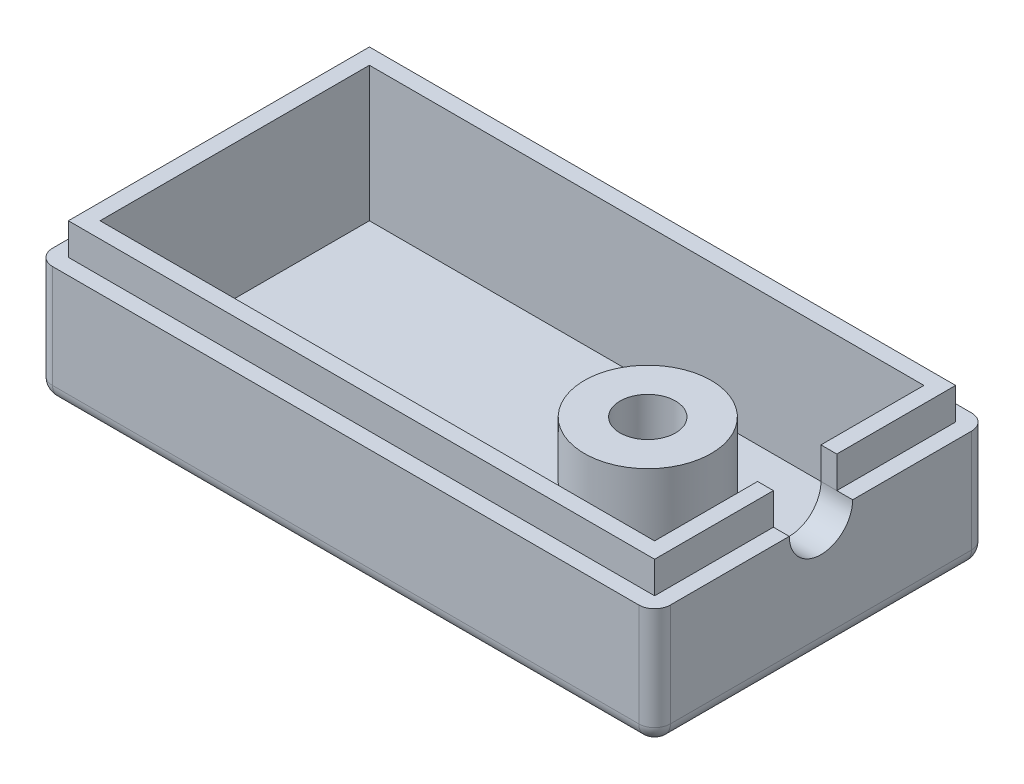
ISO-10303-21;
HEADER;
FILE_DESCRIPTION(('STEP AP214'),'2;1');
FILE_NAME('part.step','',(''),(''),'','','');
FILE_SCHEMA(('AUTOMOTIVE_DESIGN { 1 0 10303 214 1 1 1 1 }'));
ENDSEC;
DATA;
#1=APPLICATION_CONTEXT('core data for automotive mechanical design processes');
#2=APPLICATION_PROTOCOL_DEFINITION('international standard','automotive_design',2000,#1);
#3=PRODUCT_CONTEXT('',#1,'mechanical');
#4=PRODUCT('Part','Part','',(#3));
#5=PRODUCT_RELATED_PRODUCT_CATEGORY('part','',(#4));
#6=PRODUCT_DEFINITION_FORMATION('','',#4);
#7=PRODUCT_DEFINITION_CONTEXT('part definition',#1,'design');
#8=PRODUCT_DEFINITION('design','',#6,#7);
#9=PRODUCT_DEFINITION_SHAPE('','',#8);
#10=(LENGTH_UNIT() NAMED_UNIT(*) SI_UNIT(.MILLI.,.METRE.));
#11=(NAMED_UNIT(*) PLANE_ANGLE_UNIT() SI_UNIT($,.RADIAN.));
#12=(NAMED_UNIT(*) SI_UNIT($,.STERADIAN.) SOLID_ANGLE_UNIT());
#13=UNCERTAINTY_MEASURE_WITH_UNIT(LENGTH_MEASURE(1.E-05),#10,'distance_accuracy_value','');
#14=(GEOMETRIC_REPRESENTATION_CONTEXT(3) GLOBAL_UNCERTAINTY_ASSIGNED_CONTEXT((#13)) GLOBAL_UNIT_ASSIGNED_CONTEXT((#10,
#11,#12)) REPRESENTATION_CONTEXT('',''));
#15=CARTESIAN_POINT('',(0.,0.,0.));
#16=DIRECTION('',(0.,0.,1.));
#17=DIRECTION('',(1.,0.,0.));
#18=AXIS2_PLACEMENT_3D('',#15,#16,#17);
#19=CARTESIAN_POINT('',(38.,9.5,-1.));
#20=DIRECTION('',(-1.,0.,0.));
#21=DIRECTION('',(0.,0.,1.));
#22=AXIS2_PLACEMENT_3D('',#19,#20,#21);
#23=PLANE('',#22);
#24=DIRECTION('',(0.,0.,-1.));
#25=VECTOR('',#24,1.);
#26=CARTESIAN_POINT('',(38.,7.5,-1.));
#27=LINE('',#26,#25);
#28=CARTESIAN_POINT('',(38.,7.5,-1.));
#29=VERTEX_POINT('',#28);
#30=CARTESIAN_POINT('',(38.,7.5,-8.5));
#31=VERTEX_POINT('',#30);
#32=EDGE_CURVE('E367',#29,#31,#27,.T.);
#33=ORIENTED_EDGE('',*,*,#32,.T.);
#34=DIRECTION('',(0.,1.,0.));
#35=VECTOR('',#34,1.);
#36=CARTESIAN_POINT('',(38.,9.5,-8.5));
#37=LINE('',#36,#35);
#38=CARTESIAN_POINT('',(38.,9.5,-8.5));
#39=VERTEX_POINT('',#38);
#40=EDGE_CURVE('E490',#31,#39,#37,.T.);
#41=ORIENTED_EDGE('',*,*,#40,.T.);
#42=DIRECTION('',(0.,0.,-1.));
#43=VECTOR('',#42,1.);
#44=CARTESIAN_POINT('',(38.,9.5,-1.));
#45=LINE('',#44,#43);
#46=CARTESIAN_POINT('',(38.,9.5,-1.));
#47=VERTEX_POINT('',#46);
#48=EDGE_CURVE('E391',#47,#39,#45,.T.);
#49=ORIENTED_EDGE('',*,*,#48,.F.);
#50=DIRECTION('',(0.,-1.,0.));
#51=VECTOR('',#50,1.);
#52=CARTESIAN_POINT('',(38.,9.5,-1.));
#53=LINE('',#52,#51);
#54=EDGE_CURVE('E386',#47,#29,#53,.T.);
#55=ORIENTED_EDGE('',*,*,#54,.T.);
#56=EDGE_LOOP('',(#33,#41,#49,#55));
#57=FACE_BOUND('',#56,.T.);
#58=ADVANCED_FACE('F43',(#57),#23,.F.);
#59=CARTESIAN_POINT('',(28.01,-8.48528137423857,-10.56));
#60=DIRECTION('',(0.,1.,0.));
#61=DIRECTION('',(0.,0.,1.));
#62=AXIS2_PLACEMENT_3D('',#59,#60,#61);
#63=CYLINDRICAL_SURFACE('',#62,3.);
#64=CARTESIAN_POINT('',(28.01,0.,-10.56));
#65=DIRECTION('',(0.,-1.,0.));
#66=DIRECTION('',(0.,0.,-1.));
#67=AXIS2_PLACEMENT_3D('',#64,#65,#66);
#68=CIRCLE('',#67,3.);
#69=CARTESIAN_POINT('',(28.01,0.,-13.56));
#70=VERTEX_POINT('',#69);
#71=EDGE_CURVE('E478',#70,#70,#68,.F.);
#72=ORIENTED_EDGE('',*,*,#71,.F.);
#73=EDGE_LOOP('',(#72));
#74=FACE_BOUND('',#73,.T.);
#75=CARTESIAN_POINT('',(28.01,3.5,-10.56));
#76=DIRECTION('',(0.,1.,0.));
#77=DIRECTION('',(0.,0.,1.));
#78=AXIS2_PLACEMENT_3D('',#75,#76,#77);
#79=CIRCLE('',#78,3.);
#80=CARTESIAN_POINT('',(28.01,3.5,-7.56));
#81=VERTEX_POINT('',#80);
#82=EDGE_CURVE('E12',#81,#81,#79,.F.);
#83=ORIENTED_EDGE('',*,*,#82,.F.);
#84=EDGE_LOOP('',(#83));
#85=FACE_BOUND('',#84,.T.);
#86=ADVANCED_FACE('F602',(#74,#85),#63,.F.);
#87=CARTESIAN_POINT('',(0.,7.5,0.));
#88=DIRECTION('',(1.,0.,0.));
#89=DIRECTION('',(0.,0.,-1.));
#90=AXIS2_PLACEMENT_3D('',#87,#88,#89);
#91=PLANE('',#90);
#92=DIRECTION('',(0.,-1.,0.));
#93=VECTOR('',#92,1.);
#94=CARTESIAN_POINT('',(0.,7.5,-20.));
#95=LINE('',#94,#93);
#96=CARTESIAN_POINT('',(0.,7.5,-20.));
#97=VERTEX_POINT('',#96);
#98=CARTESIAN_POINT('',(0.,1.,-20.));
#99=VERTEX_POINT('',#98);
#100=EDGE_CURVE('E277',#97,#99,#95,.T.);
#101=ORIENTED_EDGE('',*,*,#100,.T.);
#102=DIRECTION('',(0.,0.,1.));
#103=VECTOR('',#102,1.);
#104=CARTESIAN_POINT('',(0.,1.,-1.));
#105=LINE('',#104,#103);
#106=CARTESIAN_POINT('',(0.,1.,-1.));
#107=VERTEX_POINT('',#106);
#108=EDGE_CURVE('E304',#99,#107,#105,.T.);
#109=ORIENTED_EDGE('',*,*,#108,.T.);
#110=DIRECTION('',(0.,-1.,0.));
#111=VECTOR('',#110,1.);
#112=CARTESIAN_POINT('',(0.,7.5,-1.));
#113=LINE('',#112,#111);
#114=CARTESIAN_POINT('',(0.,7.5,-1.));
#115=VERTEX_POINT('',#114);
#116=EDGE_CURVE('E274',#107,#115,#113,.F.);
#117=ORIENTED_EDGE('',*,*,#116,.T.);
#118=DIRECTION('',(0.,0.,1.));
#119=VECTOR('',#118,1.);
#120=CARTESIAN_POINT('',(0.,7.5,0.));
#121=LINE('',#120,#119);
#122=EDGE_CURVE('E235',#97,#115,#121,.T.);
#123=ORIENTED_EDGE('',*,*,#122,.F.);
#124=EDGE_LOOP('',(#101,#109,#117,#123));
#125=FACE_BOUND('',#124,.T.);
#126=ADVANCED_FACE('F578',(#125),#91,.F.);
#127=CARTESIAN_POINT('',(0.,7.5,0.));
#128=DIRECTION('',(0.,0.,-1.));
#129=DIRECTION('',(-1.,0.,0.));
#130=AXIS2_PLACEMENT_3D('',#127,#128,#129);
#131=PLANE('',#130);
#132=DIRECTION('',(0.,-1.,0.));
#133=VECTOR('',#132,1.);
#134=CARTESIAN_POINT('',(1.,7.5,0.));
#135=LINE('',#134,#133);
#136=CARTESIAN_POINT('',(1.,7.5,0.));
#137=VERTEX_POINT('',#136);
#138=CARTESIAN_POINT('',(1.,1.,0.));
#139=VERTEX_POINT('',#138);
#140=EDGE_CURVE('E248',#137,#139,#135,.T.);
#141=ORIENTED_EDGE('',*,*,#140,.T.);
#142=DIRECTION('',(1.,0.,0.));
#143=VECTOR('',#142,1.);
#144=CARTESIAN_POINT('',(38.,1.,0.));
#145=LINE('',#144,#143);
#146=CARTESIAN_POINT('',(38.,1.,0.));
#147=VERTEX_POINT('',#146);
#148=EDGE_CURVE('E285',#139,#147,#145,.T.);
#149=ORIENTED_EDGE('',*,*,#148,.T.);
#150=DIRECTION('',(0.,-1.,0.));
#151=VECTOR('',#150,1.);
#152=CARTESIAN_POINT('',(38.,7.5,0.));
#153=LINE('',#152,#151);
#154=CARTESIAN_POINT('',(38.,7.5,0.));
#155=VERTEX_POINT('',#154);
#156=EDGE_CURVE('E252',#147,#155,#153,.F.);
#157=ORIENTED_EDGE('',*,*,#156,.T.);
#158=DIRECTION('',(1.,0.,0.));
#159=VECTOR('',#158,1.);
#160=CARTESIAN_POINT('',(0.,7.5,0.));
#161=LINE('',#160,#159);
#162=EDGE_CURVE('E229',#137,#155,#161,.T.);
#163=ORIENTED_EDGE('',*,*,#162,.F.);
#164=EDGE_LOOP('',(#141,#149,#157,#163));
#165=FACE_BOUND('',#164,.T.);
#166=ADVANCED_FACE('F861',(#165),#131,.F.);
#167=CARTESIAN_POINT('',(39.,7.5,0.));
#168=DIRECTION('',(-1.,0.,0.));
#169=DIRECTION('',(0.,0.,1.));
#170=AXIS2_PLACEMENT_3D('',#167,#168,#169);
#171=PLANE('',#170);
#172=DIRECTION('',(0.,0.,-1.));
#173=VECTOR('',#172,1.);
#174=CARTESIAN_POINT('',(39.,7.5,0.));
#175=LINE('',#174,#173);
#176=CARTESIAN_POINT('',(39.,7.5,-12.5));
#177=VERTEX_POINT('',#176);
#178=CARTESIAN_POINT('',(39.,7.5,-20.));
#179=VERTEX_POINT('',#178);
#180=EDGE_CURVE('E216',#177,#179,#175,.T.);
#181=ORIENTED_EDGE('',*,*,#180,.F.);
#182=CARTESIAN_POINT('',(39.,7.5,-10.5));
#183=DIRECTION('',(1.,0.,0.));
#184=DIRECTION('',(0.,0.,-1.));
#185=AXIS2_PLACEMENT_3D('',#182,#183,#184);
#186=CIRCLE('',#185,2.);
#187=CARTESIAN_POINT('',(39.,7.5,-8.5));
#188=VERTEX_POINT('',#187);
#189=EDGE_CURVE('E198',#188,#177,#186,.T.);
#190=ORIENTED_EDGE('',*,*,#189,.F.);
#191=CARTESIAN_POINT('',(39.,7.5,-1.));
#192=VERTEX_POINT('',#191);
#193=EDGE_CURVE('E228',#192,#188,#175,.T.);
#194=ORIENTED_EDGE('',*,*,#193,.F.);
#195=DIRECTION('',(0.,-1.,0.));
#196=VECTOR('',#195,1.);
#197=CARTESIAN_POINT('',(39.,7.5,-1.));
#198=LINE('',#197,#196);
#199=CARTESIAN_POINT('',(39.,1.,-1.));
#200=VERTEX_POINT('',#199);
#201=EDGE_CURVE('E244',#192,#200,#198,.T.);
#202=ORIENTED_EDGE('',*,*,#201,.T.);
#203=DIRECTION('',(0.,0.,-1.));
#204=VECTOR('',#203,1.);
#205=CARTESIAN_POINT('',(39.,1.,-20.));
#206=LINE('',#205,#204);
#207=CARTESIAN_POINT('',(39.,1.,-20.));
#208=VERTEX_POINT('',#207);
#209=EDGE_CURVE('E310',#200,#208,#206,.T.);
#210=ORIENTED_EDGE('',*,*,#209,.T.);
#211=DIRECTION('',(0.,-1.,0.));
#212=VECTOR('',#211,1.);
#213=CARTESIAN_POINT('',(39.,7.5,-20.));
#214=LINE('',#213,#212);
#215=EDGE_CURVE('E225',#208,#179,#214,.F.);
#216=ORIENTED_EDGE('',*,*,#215,.T.);
#217=EDGE_LOOP('',(#181,#190,#194,#202,#210,#216));
#218=FACE_BOUND('',#217,.T.);
#219=ADVANCED_FACE('F223',(#218),#171,.F.);
#220=CARTESIAN_POINT('',(0.,7.5,-21.));
#221=DIRECTION('',(0.,0.,1.));
#222=DIRECTION('',(1.,0.,0.));
#223=AXIS2_PLACEMENT_3D('',#220,#221,#222);
#224=PLANE('',#223);
#225=DIRECTION('',(0.,-1.,0.));
#226=VECTOR('',#225,1.);
#227=CARTESIAN_POINT('',(38.,7.5,-21.));
#228=LINE('',#227,#226);
#229=CARTESIAN_POINT('',(38.,7.5,-21.));
#230=VERTEX_POINT('',#229);
#231=CARTESIAN_POINT('',(38.,1.,-21.));
#232=VERTEX_POINT('',#231);
#233=EDGE_CURVE('E270',#230,#232,#228,.T.);
#234=ORIENTED_EDGE('',*,*,#233,.T.);
#235=DIRECTION('',(-1.,0.,0.));
#236=VECTOR('',#235,1.);
#237=CARTESIAN_POINT('',(1.,1.,-21.));
#238=LINE('',#237,#236);
#239=CARTESIAN_POINT('',(1.,1.,-21.));
#240=VERTEX_POINT('',#239);
#241=EDGE_CURVE('E52',#232,#240,#238,.T.);
#242=ORIENTED_EDGE('',*,*,#241,.T.);
#243=DIRECTION('',(0.,-1.,0.));
#244=VECTOR('',#243,1.);
#245=CARTESIAN_POINT('',(1.,7.5,-21.));
#246=LINE('',#245,#244);
#247=CARTESIAN_POINT('',(1.,7.5,-21.));
#248=VERTEX_POINT('',#247);
#249=EDGE_CURVE('E267',#240,#248,#246,.F.);
#250=ORIENTED_EDGE('',*,*,#249,.T.);
#251=DIRECTION('',(-1.,0.,0.));
#252=VECTOR('',#251,1.);
#253=CARTESIAN_POINT('',(0.,7.5,-21.));
#254=LINE('',#253,#252);
#255=EDGE_CURVE('E233',#230,#248,#254,.T.);
#256=ORIENTED_EDGE('',*,*,#255,.F.);
#257=EDGE_LOOP('',(#234,#242,#250,#256));
#258=FACE_BOUND('',#257,.T.);
#259=ADVANCED_FACE('F571',(#258),#224,.F.);
#260=CARTESIAN_POINT('',(0.,7.5,0.));
#261=DIRECTION('',(0.,-1.,0.));
#262=DIRECTION('',(0.,0.,-1.));
#263=AXIS2_PLACEMENT_3D('',#260,#261,#262);
#264=PLANE('',#263);
#265=ORIENTED_EDGE('',*,*,#193,.T.);
#266=DIRECTION('',(1.,0.,0.));
#267=VECTOR('',#266,1.);
#268=CARTESIAN_POINT('',(31.3431457505076,7.5,-8.5));
#269=LINE('',#268,#267);
#270=EDGE_CURVE('E206',#31,#188,#269,.T.);
#271=ORIENTED_EDGE('',*,*,#270,.F.);
#272=ORIENTED_EDGE('',*,*,#32,.F.);
#273=DIRECTION('',(1.,0.,0.));
#274=VECTOR('',#273,1.);
#275=CARTESIAN_POINT('',(1.,7.5,-1.));
#276=LINE('',#275,#274);
#277=CARTESIAN_POINT('',(1.,7.5,-1.));
#278=VERTEX_POINT('',#277);
#279=EDGE_CURVE('E362',#278,#29,#276,.T.);
#280=ORIENTED_EDGE('',*,*,#279,.F.);
#281=DIRECTION('',(0.,0.,1.));
#282=VECTOR('',#281,1.);
#283=CARTESIAN_POINT('',(1.,7.5,-20.));
#284=LINE('',#283,#282);
#285=CARTESIAN_POINT('',(1.,7.5,-20.));
#286=VERTEX_POINT('',#285);
#287=EDGE_CURVE('E354',#286,#278,#284,.T.);
#288=ORIENTED_EDGE('',*,*,#287,.F.);
#289=DIRECTION('',(-1.,0.,0.));
#290=VECTOR('',#289,1.);
#291=CARTESIAN_POINT('',(38.,7.5,-20.));
#292=LINE('',#291,#290);
#293=CARTESIAN_POINT('',(38.,7.5,-20.));
#294=VERTEX_POINT('',#293);
#295=EDGE_CURVE('E347',#294,#286,#292,.T.);
#296=ORIENTED_EDGE('',*,*,#295,.F.);
#297=CARTESIAN_POINT('',(38.,7.5,-12.5));
#298=VERTEX_POINT('',#297);
#299=EDGE_CURVE('E219',#298,#294,#27,.T.);
#300=ORIENTED_EDGE('',*,*,#299,.F.);
#301=DIRECTION('',(1.,0.,0.));
#302=VECTOR('',#301,1.);
#303=CARTESIAN_POINT('',(31.3431457505076,7.5,-12.5));
#304=LINE('',#303,#302);
#305=EDGE_CURVE('E202',#298,#177,#304,.T.);
#306=ORIENTED_EDGE('',*,*,#305,.T.);
#307=ORIENTED_EDGE('',*,*,#180,.T.);
#308=CARTESIAN_POINT('',(38.,7.5,-20.));
#309=DIRECTION('',(0.,-1.,0.));
#310=DIRECTION('',(0.,0.,-1.));
#311=AXIS2_PLACEMENT_3D('',#308,#309,#310);
#312=CIRCLE('',#311,1.);
#313=EDGE_CURVE('E261',#179,#230,#312,.F.);
#314=ORIENTED_EDGE('',*,*,#313,.T.);
#315=ORIENTED_EDGE('',*,*,#255,.T.);
#316=CARTESIAN_POINT('',(1.,7.5,-20.));
#317=DIRECTION('',(0.,-1.,0.));
#318=DIRECTION('',(0.,0.,-1.));
#319=AXIS2_PLACEMENT_3D('',#316,#317,#318);
#320=CIRCLE('',#319,1.);
#321=EDGE_CURVE('E258',#248,#97,#320,.F.);
#322=ORIENTED_EDGE('',*,*,#321,.T.);
#323=ORIENTED_EDGE('',*,*,#122,.T.);
#324=CARTESIAN_POINT('',(1.,7.5,-1.));
#325=DIRECTION('',(0.,-1.,0.));
#326=DIRECTION('',(0.,0.,-1.));
#327=AXIS2_PLACEMENT_3D('',#324,#325,#326);
#328=CIRCLE('',#327,1.);
#329=EDGE_CURVE('E255',#115,#137,#328,.F.);
#330=ORIENTED_EDGE('',*,*,#329,.T.);
#331=ORIENTED_EDGE('',*,*,#162,.T.);
#332=CARTESIAN_POINT('',(38.,7.5,-1.));
#333=DIRECTION('',(0.,-1.,0.));
#334=DIRECTION('',(0.,0.,-1.));
#335=AXIS2_PLACEMENT_3D('',#332,#333,#334);
#336=CIRCLE('',#335,1.);
#337=EDGE_CURVE('E264',#155,#192,#336,.F.);
#338=ORIENTED_EDGE('',*,*,#337,.T.);
#339=EDGE_LOOP('',(#265,#271,#272,#280,#288,#296,#300,#306,#307,#314,#315,#322,#323,#330,#331,#338));
#340=FACE_BOUND('',#339,.T.);
#341=ADVANCED_FACE('F215',(#340),#264,.F.);
#342=CARTESIAN_POINT('',(0.,0.,0.));
#343=DIRECTION('',(0.,-1.,0.));
#344=DIRECTION('',(0.,0.,-1.));
#345=AXIS2_PLACEMENT_3D('',#342,#343,#344);
#346=PLANE('',#345);
#347=ORIENTED_EDGE('',*,*,#71,.T.);
#348=EDGE_LOOP('',(#347));
#349=FACE_BOUND('',#348,.T.);
#350=DIRECTION('',(0.,0.,-1.));
#351=VECTOR('',#350,1.);
#352=CARTESIAN_POINT('',(38.,0.,-1.));
#353=LINE('',#352,#351);
#354=CARTESIAN_POINT('',(38.,0.,-20.));
#355=VERTEX_POINT('',#354);
#356=CARTESIAN_POINT('',(38.,0.,-1.));
#357=VERTEX_POINT('',#356);
#358=EDGE_CURVE('E291',#355,#357,#353,.F.);
#359=ORIENTED_EDGE('',*,*,#358,.T.);
#360=DIRECTION('',(1.,0.,0.));
#361=VECTOR('',#360,1.);
#362=CARTESIAN_POINT('',(1.,0.,-1.));
#363=LINE('',#362,#361);
#364=CARTESIAN_POINT('',(1.,0.,-1.));
#365=VERTEX_POINT('',#364);
#366=EDGE_CURVE('E297',#357,#365,#363,.F.);
#367=ORIENTED_EDGE('',*,*,#366,.T.);
#368=DIRECTION('',(0.,0.,1.));
#369=VECTOR('',#368,1.);
#370=CARTESIAN_POINT('',(1.,0.,-20.));
#371=LINE('',#370,#369);
#372=CARTESIAN_POINT('',(1.,0.,-20.));
#373=VERTEX_POINT('',#372);
#374=EDGE_CURVE('E294',#365,#373,#371,.F.);
#375=ORIENTED_EDGE('',*,*,#374,.T.);
#376=DIRECTION('',(-1.,0.,0.));
#377=VECTOR('',#376,1.);
#378=CARTESIAN_POINT('',(38.,0.,-20.));
#379=LINE('',#378,#377);
#380=EDGE_CURVE('E288',#373,#355,#379,.F.);
#381=ORIENTED_EDGE('',*,*,#380,.T.);
#382=EDGE_LOOP('',(#359,#367,#375,#381));
#383=FACE_BOUND('',#382,.T.);
#384=ADVANCED_FACE('F555',(#349,#383),#346,.T.);
#385=CARTESIAN_POINT('',(38.,7.5,-1.));
#386=DIRECTION('',(0.,-1.,0.));
#387=DIRECTION('',(0.,0.,-1.));
#388=AXIS2_PLACEMENT_3D('',#385,#386,#387);
#389=CYLINDRICAL_SURFACE('',#388,1.);
#390=ORIENTED_EDGE('',*,*,#156,.F.);
#391=CARTESIAN_POINT('',(38.,1.,-1.));
#392=DIRECTION('',(0.,-1.,0.));
#393=DIRECTION('',(0.,0.,-1.));
#394=AXIS2_PLACEMENT_3D('',#391,#392,#393);
#395=CIRCLE('',#394,1.);
#396=EDGE_CURVE('E301',#147,#200,#395,.F.);
#397=ORIENTED_EDGE('',*,*,#396,.T.);
#398=ORIENTED_EDGE('',*,*,#201,.F.);
#399=ORIENTED_EDGE('',*,*,#337,.F.);
#400=EDGE_LOOP('',(#390,#397,#398,#399));
#401=FACE_BOUND('',#400,.T.);
#402=ADVANCED_FACE('F542',(#401),#389,.T.);
#403=CARTESIAN_POINT('',(38.,7.5,-20.));
#404=DIRECTION('',(0.,-1.,0.));
#405=DIRECTION('',(0.,0.,-1.));
#406=AXIS2_PLACEMENT_3D('',#403,#404,#405);
#407=CYLINDRICAL_SURFACE('',#406,1.);
#408=ORIENTED_EDGE('',*,*,#215,.F.);
#409=CARTESIAN_POINT('',(38.,1.,-20.));
#410=DIRECTION('',(0.,-1.,0.));
#411=DIRECTION('',(0.,0.,-1.));
#412=AXIS2_PLACEMENT_3D('',#409,#410,#411);
#413=CIRCLE('',#412,1.);
#414=EDGE_CURVE('E313',#208,#232,#413,.F.);
#415=ORIENTED_EDGE('',*,*,#414,.T.);
#416=ORIENTED_EDGE('',*,*,#233,.F.);
#417=ORIENTED_EDGE('',*,*,#313,.F.);
#418=EDGE_LOOP('',(#408,#415,#416,#417));
#419=FACE_BOUND('',#418,.T.);
#420=ADVANCED_FACE('F560',(#419),#407,.T.);
#421=CARTESIAN_POINT('',(1.,7.5,-20.));
#422=DIRECTION('',(0.,-1.,0.));
#423=DIRECTION('',(0.,0.,-1.));
#424=AXIS2_PLACEMENT_3D('',#421,#422,#423);
#425=CYLINDRICAL_SURFACE('',#424,1.);
#426=ORIENTED_EDGE('',*,*,#249,.F.);
#427=CARTESIAN_POINT('',(1.,1.,-20.));
#428=DIRECTION('',(0.,-1.,0.));
#429=DIRECTION('',(0.,0.,-1.));
#430=AXIS2_PLACEMENT_3D('',#427,#428,#429);
#431=CIRCLE('',#430,1.);
#432=EDGE_CURVE('E307',#240,#99,#431,.F.);
#433=ORIENTED_EDGE('',*,*,#432,.T.);
#434=ORIENTED_EDGE('',*,*,#100,.F.);
#435=ORIENTED_EDGE('',*,*,#321,.F.);
#436=EDGE_LOOP('',(#426,#433,#434,#435));
#437=FACE_BOUND('',#436,.T.);
#438=ADVANCED_FACE('F575',(#437),#425,.T.);
#439=CARTESIAN_POINT('',(1.,7.5,-1.));
#440=DIRECTION('',(0.,-1.,0.));
#441=DIRECTION('',(0.,0.,-1.));
#442=AXIS2_PLACEMENT_3D('',#439,#440,#441);
#443=CYLINDRICAL_SURFACE('',#442,1.);
#444=ORIENTED_EDGE('',*,*,#116,.F.);
#445=CARTESIAN_POINT('',(1.,1.,-1.));
#446=DIRECTION('',(0.,-1.,0.));
#447=DIRECTION('',(0.,0.,-1.));
#448=AXIS2_PLACEMENT_3D('',#445,#446,#447);
#449=CIRCLE('',#448,1.);
#450=EDGE_CURVE('E281',#107,#139,#449,.F.);
#451=ORIENTED_EDGE('',*,*,#450,.T.);
#452=ORIENTED_EDGE('',*,*,#140,.F.);
#453=ORIENTED_EDGE('',*,*,#329,.F.);
#454=EDGE_LOOP('',(#444,#451,#452,#453));
#455=FACE_BOUND('',#454,.T.);
#456=ADVANCED_FACE('F584',(#455),#443,.T.);
#457=CARTESIAN_POINT('',(38.,1.,-20.));
#458=DIRECTION('',(0.,-1.,0.));
#459=DIRECTION('',(0.,0.,-1.));
#460=AXIS2_PLACEMENT_3D('',#457,#458,#459);
#461=SPHERICAL_SURFACE('',#460,1.);
#462=CARTESIAN_POINT('',(38.,1.,-20.));
#463=DIRECTION('',(-1.,0.,0.));
#464=DIRECTION('',(0.,0.,1.));
#465=AXIS2_PLACEMENT_3D('',#462,#463,#464);
#466=CIRCLE('',#465,1.);
#467=EDGE_CURVE('E341',#232,#355,#466,.T.);
#468=ORIENTED_EDGE('',*,*,#467,.F.);
#469=ORIENTED_EDGE('',*,*,#414,.F.);
#470=CARTESIAN_POINT('',(38.,1.,-20.));
#471=DIRECTION('',(0.,0.,1.));
#472=DIRECTION('',(1.,0.,0.));
#473=AXIS2_PLACEMENT_3D('',#470,#471,#472);
#474=CIRCLE('',#473,1.);
#475=EDGE_CURVE('E344',#355,#208,#474,.T.);
#476=ORIENTED_EDGE('',*,*,#475,.F.);
#477=EDGE_LOOP('',(#468,#469,#476));
#478=FACE_BOUND('',#477,.T.);
#479=ADVANCED_FACE('F45',(#478),#461,.T.);
#480=CARTESIAN_POINT('',(38.,1.,0.));
#481=DIRECTION('',(0.,0.,1.));
#482=DIRECTION('',(1.,0.,0.));
#483=AXIS2_PLACEMENT_3D('',#480,#481,#482);
#484=CYLINDRICAL_SURFACE('',#483,1.);
#485=ORIENTED_EDGE('',*,*,#475,.T.);
#486=ORIENTED_EDGE('',*,*,#209,.F.);
#487=CARTESIAN_POINT('',(38.,1.,-1.));
#488=DIRECTION('',(0.,0.,1.));
#489=DIRECTION('',(1.,0.,0.));
#490=AXIS2_PLACEMENT_3D('',#487,#488,#489);
#491=CIRCLE('',#490,1.);
#492=EDGE_CURVE('E337',#357,#200,#491,.T.);
#493=ORIENTED_EDGE('',*,*,#492,.F.);
#494=ORIENTED_EDGE('',*,*,#358,.F.);
#495=EDGE_LOOP('',(#485,#486,#493,#494));
#496=FACE_BOUND('',#495,.T.);
#497=ADVANCED_FACE('F557',(#496),#484,.T.);
#498=CARTESIAN_POINT('',(0.,1.,-20.));
#499=DIRECTION('',(1.,0.,0.));
#500=DIRECTION('',(0.,0.,-1.));
#501=AXIS2_PLACEMENT_3D('',#498,#499,#500);
#502=CYLINDRICAL_SURFACE('',#501,1.);
#503=ORIENTED_EDGE('',*,*,#467,.T.);
#504=ORIENTED_EDGE('',*,*,#380,.F.);
#505=CARTESIAN_POINT('',(1.,1.,-20.));
#506=DIRECTION('',(-1.,0.,0.));
#507=DIRECTION('',(0.,0.,1.));
#508=AXIS2_PLACEMENT_3D('',#505,#506,#507);
#509=CIRCLE('',#508,1.);
#510=EDGE_CURVE('E333',#240,#373,#509,.T.);
#511=ORIENTED_EDGE('',*,*,#510,.F.);
#512=ORIENTED_EDGE('',*,*,#241,.F.);
#513=EDGE_LOOP('',(#503,#504,#511,#512));
#514=FACE_BOUND('',#513,.T.);
#515=ADVANCED_FACE('F567',(#514),#502,.T.);
#516=CARTESIAN_POINT('',(38.,1.,-1.));
#517=DIRECTION('',(0.,-1.,0.));
#518=DIRECTION('',(0.,0.,-1.));
#519=AXIS2_PLACEMENT_3D('',#516,#517,#518);
#520=SPHERICAL_SURFACE('',#519,1.);
#521=ORIENTED_EDGE('',*,*,#492,.T.);
#522=ORIENTED_EDGE('',*,*,#396,.F.);
#523=CARTESIAN_POINT('',(38.,1.,-1.));
#524=DIRECTION('',(-1.,0.,0.));
#525=DIRECTION('',(0.,0.,1.));
#526=AXIS2_PLACEMENT_3D('',#523,#524,#525);
#527=CIRCLE('',#526,1.);
#528=EDGE_CURVE('E329',#357,#147,#527,.T.);
#529=ORIENTED_EDGE('',*,*,#528,.F.);
#530=EDGE_LOOP('',(#521,#522,#529));
#531=FACE_BOUND('',#530,.T.);
#532=ADVANCED_FACE('F546',(#531),#520,.T.);
#533=CARTESIAN_POINT('',(1.,1.,-20.));
#534=DIRECTION('',(0.,-1.,0.));
#535=DIRECTION('',(0.,0.,-1.));
#536=AXIS2_PLACEMENT_3D('',#533,#534,#535);
#537=SPHERICAL_SURFACE('',#536,1.);
#538=ORIENTED_EDGE('',*,*,#432,.F.);
#539=ORIENTED_EDGE('',*,*,#510,.T.);
#540=CARTESIAN_POINT('',(1.,1.,-20.));
#541=DIRECTION('',(0.,0.,1.));
#542=DIRECTION('',(1.,0.,0.));
#543=AXIS2_PLACEMENT_3D('',#540,#541,#542);
#544=CIRCLE('',#543,1.);
#545=EDGE_CURVE('E325',#99,#373,#544,.T.);
#546=ORIENTED_EDGE('',*,*,#545,.F.);
#547=EDGE_LOOP('',(#538,#539,#546));
#548=FACE_BOUND('',#547,.T.);
#549=ADVANCED_FACE('F592',(#548),#537,.T.);
#550=CARTESIAN_POINT('',(0.,1.,-1.));
#551=DIRECTION('',(-1.,0.,0.));
#552=DIRECTION('',(0.,0.,1.));
#553=AXIS2_PLACEMENT_3D('',#550,#551,#552);
#554=CYLINDRICAL_SURFACE('',#553,1.);
#555=ORIENTED_EDGE('',*,*,#528,.T.);
#556=ORIENTED_EDGE('',*,*,#148,.F.);
#557=CARTESIAN_POINT('',(1.,1.,-1.));
#558=DIRECTION('',(-1.,0.,0.));
#559=DIRECTION('',(0.,0.,1.));
#560=AXIS2_PLACEMENT_3D('',#557,#558,#559);
#561=CIRCLE('',#560,1.);
#562=EDGE_CURVE('E321',#365,#139,#561,.T.);
#563=ORIENTED_EDGE('',*,*,#562,.F.);
#564=ORIENTED_EDGE('',*,*,#366,.F.);
#565=EDGE_LOOP('',(#555,#556,#563,#564));
#566=FACE_BOUND('',#565,.T.);
#567=ADVANCED_FACE('F551',(#566),#554,.T.);
#568=CARTESIAN_POINT('',(1.,1.,0.));
#569=DIRECTION('',(0.,0.,-1.));
#570=DIRECTION('',(-1.,0.,0.));
#571=AXIS2_PLACEMENT_3D('',#568,#569,#570);
#572=CYLINDRICAL_SURFACE('',#571,1.);
#573=ORIENTED_EDGE('',*,*,#545,.T.);
#574=ORIENTED_EDGE('',*,*,#374,.F.);
#575=CARTESIAN_POINT('',(1.,1.,-1.));
#576=DIRECTION('',(0.,0.,1.));
#577=DIRECTION('',(1.,0.,0.));
#578=AXIS2_PLACEMENT_3D('',#575,#576,#577);
#579=CIRCLE('',#578,1.);
#580=EDGE_CURVE('E318',#107,#365,#579,.T.);
#581=ORIENTED_EDGE('',*,*,#580,.F.);
#582=ORIENTED_EDGE('',*,*,#108,.F.);
#583=EDGE_LOOP('',(#573,#574,#581,#582));
#584=FACE_BOUND('',#583,.T.);
#585=ADVANCED_FACE('F590',(#584),#572,.T.);
#586=CARTESIAN_POINT('',(1.,1.,-1.));
#587=DIRECTION('',(0.,-1.,0.));
#588=DIRECTION('',(0.,0.,-1.));
#589=AXIS2_PLACEMENT_3D('',#586,#587,#588);
#590=SPHERICAL_SURFACE('',#589,1.);
#591=ORIENTED_EDGE('',*,*,#562,.T.);
#592=ORIENTED_EDGE('',*,*,#450,.F.);
#593=ORIENTED_EDGE('',*,*,#580,.T.);
#594=EDGE_LOOP('',(#591,#592,#593));
#595=FACE_BOUND('',#594,.T.);
#596=ADVANCED_FACE('F588',(#595),#590,.T.);
#597=CARTESIAN_POINT('',(38.,9.5,-20.));
#598=DIRECTION('',(0.,0.,1.));
#599=DIRECTION('',(1.,0.,0.));
#600=AXIS2_PLACEMENT_3D('',#597,#598,#599);
#601=PLANE('',#600);
#602=DIRECTION('',(0.,-1.,0.));
#603=VECTOR('',#602,1.);
#604=CARTESIAN_POINT('',(38.,9.5,-20.));
#605=LINE('',#604,#603);
#606=CARTESIAN_POINT('',(38.,9.5,-20.));
#607=VERTEX_POINT('',#606);
#608=EDGE_CURVE('E322',#607,#294,#605,.T.);
#609=ORIENTED_EDGE('',*,*,#608,.T.);
#610=ORIENTED_EDGE('',*,*,#295,.T.);
#611=DIRECTION('',(0.,-1.,0.));
#612=VECTOR('',#611,1.);
#613=CARTESIAN_POINT('',(1.,9.5,-20.));
#614=LINE('',#613,#612);
#615=CARTESIAN_POINT('',(1.,9.5,-20.));
#616=VERTEX_POINT('',#615);
#617=EDGE_CURVE('E397',#616,#286,#614,.T.);
#618=ORIENTED_EDGE('',*,*,#617,.F.);
#619=DIRECTION('',(-1.,0.,0.));
#620=VECTOR('',#619,1.);
#621=CARTESIAN_POINT('',(38.,9.5,-20.));
#622=LINE('',#621,#620);
#623=EDGE_CURVE('E409',#607,#616,#622,.T.);
#624=ORIENTED_EDGE('',*,*,#623,.F.);
#625=EDGE_LOOP('',(#609,#610,#618,#624));
#626=FACE_BOUND('',#625,.T.);
#627=ADVANCED_FACE('F408',(#626),#601,.F.);
#628=CARTESIAN_POINT('',(1.,9.5,-1.));
#629=DIRECTION('',(0.,0.,-1.));
#630=DIRECTION('',(-1.,0.,0.));
#631=AXIS2_PLACEMENT_3D('',#628,#629,#630);
#632=PLANE('',#631);
#633=DIRECTION('',(0.,-1.,0.));
#634=VECTOR('',#633,1.);
#635=CARTESIAN_POINT('',(1.,9.5,-1.));
#636=LINE('',#635,#634);
#637=CARTESIAN_POINT('',(1.,9.5,-1.));
#638=VERTEX_POINT('',#637);
#639=EDGE_CURVE('E389',#638,#278,#636,.T.);
#640=ORIENTED_EDGE('',*,*,#639,.T.);
#641=ORIENTED_EDGE('',*,*,#279,.T.);
#642=ORIENTED_EDGE('',*,*,#54,.F.);
#643=DIRECTION('',(1.,0.,0.));
#644=VECTOR('',#643,1.);
#645=CARTESIAN_POINT('',(1.,9.5,-1.));
#646=LINE('',#645,#644);
#647=EDGE_CURVE('E393',#638,#47,#646,.T.);
#648=ORIENTED_EDGE('',*,*,#647,.F.);
#649=EDGE_LOOP('',(#640,#641,#642,#648));
#650=FACE_BOUND('',#649,.T.);
#651=ADVANCED_FACE('F384',(#650),#632,.F.);
#652=CARTESIAN_POINT('',(38.,9.5,-12.5));
#653=VERTEX_POINT('',#652);
#654=EDGE_CURVE('E414',#653,#607,#45,.T.);
#655=ORIENTED_EDGE('',*,*,#654,.F.);
#656=DIRECTION('',(0.,-1.,0.));
#657=VECTOR('',#656,1.);
#658=CARTESIAN_POINT('',(38.,9.49999999999999,-12.5));
#659=LINE('',#658,#657);
#660=EDGE_CURVE('E415',#653,#298,#659,.T.);
#661=ORIENTED_EDGE('',*,*,#660,.T.);
#662=ORIENTED_EDGE('',*,*,#299,.T.);
#663=ORIENTED_EDGE('',*,*,#608,.F.);
#664=EDGE_LOOP('',(#655,#661,#662,#663));
#665=FACE_BOUND('',#664,.T.);
#666=ADVANCED_FACE('F412',(#665),#23,.F.);
#667=CARTESIAN_POINT('',(1.,9.5,-20.));
#668=DIRECTION('',(1.,0.,0.));
#669=DIRECTION('',(0.,0.,-1.));
#670=AXIS2_PLACEMENT_3D('',#667,#668,#669);
#671=PLANE('',#670);
#672=ORIENTED_EDGE('',*,*,#617,.T.);
#673=ORIENTED_EDGE('',*,*,#287,.T.);
#674=ORIENTED_EDGE('',*,*,#639,.F.);
#675=DIRECTION('',(0.,0.,1.));
#676=VECTOR('',#675,1.);
#677=CARTESIAN_POINT('',(1.,9.5,-20.));
#678=LINE('',#677,#676);
#679=EDGE_CURVE('E399',#616,#638,#678,.T.);
#680=ORIENTED_EDGE('',*,*,#679,.F.);
#681=EDGE_LOOP('',(#672,#673,#674,#680));
#682=FACE_BOUND('',#681,.T.);
#683=ADVANCED_FACE('F416',(#682),#671,.F.);
#684=CARTESIAN_POINT('',(0.,9.5,0.));
#685=DIRECTION('',(0.,1.,0.));
#686=DIRECTION('',(0.,0.,1.));
#687=AXIS2_PLACEMENT_3D('',#684,#685,#686);
#688=PLANE('',#687);
#689=DIRECTION('',(1.,0.,0.));
#690=VECTOR('',#689,1.);
#691=CARTESIAN_POINT('',(31.3431457505076,9.5,-8.5));
#692=LINE('',#691,#690);
#693=CARTESIAN_POINT('',(37.,9.5,-8.5));
#694=VERTEX_POINT('',#693);
#695=EDGE_CURVE('E502',#694,#39,#692,.T.);
#696=ORIENTED_EDGE('',*,*,#695,.F.);
#697=DIRECTION('',(0.,0.,-1.));
#698=VECTOR('',#697,1.);
#699=CARTESIAN_POINT('',(37.,9.5,-2.));
#700=LINE('',#699,#698);
#701=CARTESIAN_POINT('',(37.,9.5,-2.));
#702=VERTEX_POINT('',#701);
#703=EDGE_CURVE('E449',#702,#694,#700,.T.);
#704=ORIENTED_EDGE('',*,*,#703,.F.);
#705=DIRECTION('',(1.,0.,0.));
#706=VECTOR('',#705,1.);
#707=CARTESIAN_POINT('',(2.,9.5,-2.));
#708=LINE('',#707,#706);
#709=CARTESIAN_POINT('',(2.,9.5,-2.));
#710=VERTEX_POINT('',#709);
#711=EDGE_CURVE('E67',#710,#702,#708,.T.);
#712=ORIENTED_EDGE('',*,*,#711,.F.);
#713=DIRECTION('',(0.,0.,1.));
#714=VECTOR('',#713,1.);
#715=CARTESIAN_POINT('',(2.,9.5,-19.));
#716=LINE('',#715,#714);
#717=CARTESIAN_POINT('',(2.,9.5,-19.));
#718=VERTEX_POINT('',#717);
#719=EDGE_CURVE('E440',#718,#710,#716,.T.);
#720=ORIENTED_EDGE('',*,*,#719,.F.);
#721=DIRECTION('',(-1.,0.,0.));
#722=VECTOR('',#721,1.);
#723=CARTESIAN_POINT('',(37.,9.5,-19.));
#724=LINE('',#723,#722);
#725=CARTESIAN_POINT('',(37.,9.5,-19.));
#726=VERTEX_POINT('',#725);
#727=EDGE_CURVE('E445',#726,#718,#724,.T.);
#728=ORIENTED_EDGE('',*,*,#727,.F.);
#729=CARTESIAN_POINT('',(37.,9.5,-12.5));
#730=VERTEX_POINT('',#729);
#731=EDGE_CURVE('E453',#730,#726,#700,.T.);
#732=ORIENTED_EDGE('',*,*,#731,.F.);
#733=DIRECTION('',(1.,0.,0.));
#734=VECTOR('',#733,1.);
#735=CARTESIAN_POINT('',(31.3431457505076,9.5,-12.5));
#736=LINE('',#735,#734);
#737=EDGE_CURVE('E59',#730,#653,#736,.T.);
#738=ORIENTED_EDGE('',*,*,#737,.T.);
#739=ORIENTED_EDGE('',*,*,#654,.T.);
#740=ORIENTED_EDGE('',*,*,#623,.T.);
#741=ORIENTED_EDGE('',*,*,#679,.T.);
#742=ORIENTED_EDGE('',*,*,#647,.T.);
#743=ORIENTED_EDGE('',*,*,#48,.T.);
#744=EDGE_LOOP('',(#696,#704,#712,#720,#728,#732,#738,#739,#740,#741,#742,#743));
#745=FACE_BOUND('',#744,.T.);
#746=ADVANCED_FACE('F419',(#745),#688,.T.);
#747=CARTESIAN_POINT('',(2.,1.,-2.));
#748=DIRECTION('',(0.,0.,1.));
#749=DIRECTION('',(1.,0.,0.));
#750=AXIS2_PLACEMENT_3D('',#747,#748,#749);
#751=PLANE('',#750);
#752=ORIENTED_EDGE('',*,*,#711,.T.);
#753=DIRECTION('',(0.,1.,0.));
#754=VECTOR('',#753,1.);
#755=CARTESIAN_POINT('',(37.,1.,-2.));
#756=LINE('',#755,#754);
#757=CARTESIAN_POINT('',(37.,1.,-2.));
#758=VERTEX_POINT('',#757);
#759=EDGE_CURVE('E426',#758,#702,#756,.T.);
#760=ORIENTED_EDGE('',*,*,#759,.F.);
#761=DIRECTION('',(1.,0.,0.));
#762=VECTOR('',#761,1.);
#763=CARTESIAN_POINT('',(2.,1.,-2.));
#764=LINE('',#763,#762);
#765=CARTESIAN_POINT('',(2.,1.,-2.));
#766=VERTEX_POINT('',#765);
#767=EDGE_CURVE('E444',#766,#758,#764,.T.);
#768=ORIENTED_EDGE('',*,*,#767,.F.);
#769=DIRECTION('',(0.,1.,0.));
#770=VECTOR('',#769,1.);
#771=CARTESIAN_POINT('',(2.,1.,-2.));
#772=LINE('',#771,#770);
#773=EDGE_CURVE('E437',#766,#710,#772,.T.);
#774=ORIENTED_EDGE('',*,*,#773,.T.);
#775=EDGE_LOOP('',(#752,#760,#768,#774));
#776=FACE_BOUND('',#775,.T.);
#777=ADVANCED_FACE('F522',(#776),#751,.F.);
#778=CARTESIAN_POINT('',(2.,1.,-19.));
#779=DIRECTION('',(-1.,0.,0.));
#780=DIRECTION('',(0.,0.,1.));
#781=AXIS2_PLACEMENT_3D('',#778,#779,#780);
#782=PLANE('',#781);
#783=ORIENTED_EDGE('',*,*,#719,.T.);
#784=ORIENTED_EDGE('',*,*,#773,.F.);
#785=DIRECTION('',(0.,0.,1.));
#786=VECTOR('',#785,1.);
#787=CARTESIAN_POINT('',(2.,1.,-19.));
#788=LINE('',#787,#786);
#789=CARTESIAN_POINT('',(2.,1.,-19.));
#790=VERTEX_POINT('',#789);
#791=EDGE_CURVE('E430',#790,#766,#788,.T.);
#792=ORIENTED_EDGE('',*,*,#791,.F.);
#793=DIRECTION('',(0.,1.,0.));
#794=VECTOR('',#793,1.);
#795=CARTESIAN_POINT('',(2.,1.,-19.));
#796=LINE('',#795,#794);
#797=EDGE_CURVE('E434',#790,#718,#796,.T.);
#798=ORIENTED_EDGE('',*,*,#797,.T.);
#799=EDGE_LOOP('',(#783,#784,#792,#798));
#800=FACE_BOUND('',#799,.T.);
#801=ADVANCED_FACE('F528',(#800),#782,.F.);
#802=CARTESIAN_POINT('',(37.,1.,-19.));
#803=DIRECTION('',(0.,0.,-1.));
#804=DIRECTION('',(-1.,0.,0.));
#805=AXIS2_PLACEMENT_3D('',#802,#803,#804);
#806=PLANE('',#805);
#807=ORIENTED_EDGE('',*,*,#727,.T.);
#808=ORIENTED_EDGE('',*,*,#797,.F.);
#809=DIRECTION('',(-1.,0.,0.));
#810=VECTOR('',#809,1.);
#811=CARTESIAN_POINT('',(37.,1.,-19.));
#812=LINE('',#811,#810);
#813=CARTESIAN_POINT('',(37.,1.,-19.));
#814=VERTEX_POINT('',#813);
#815=EDGE_CURVE('E460',#814,#790,#812,.T.);
#816=ORIENTED_EDGE('',*,*,#815,.F.);
#817=DIRECTION('',(0.,1.,0.));
#818=VECTOR('',#817,1.);
#819=CARTESIAN_POINT('',(37.,1.,-19.));
#820=LINE('',#819,#818);
#821=EDGE_CURVE('E429',#814,#726,#820,.T.);
#822=ORIENTED_EDGE('',*,*,#821,.T.);
#823=EDGE_LOOP('',(#807,#808,#816,#822));
#824=FACE_BOUND('',#823,.T.);
#825=ADVANCED_FACE('F533',(#824),#806,.F.);
#826=CARTESIAN_POINT('',(37.,1.,-2.));
#827=DIRECTION('',(1.,0.,0.));
#828=DIRECTION('',(0.,0.,-1.));
#829=AXIS2_PLACEMENT_3D('',#826,#827,#828);
#830=PLANE('',#829);
#831=ORIENTED_EDGE('',*,*,#703,.T.);
#832=DIRECTION('',(0.,1.,0.));
#833=VECTOR('',#832,1.);
#834=CARTESIAN_POINT('',(37.,7.5,-8.5));
#835=LINE('',#834,#833);
#836=CARTESIAN_POINT('',(37.,7.5,-8.5));
#837=VERTEX_POINT('',#836);
#838=EDGE_CURVE('E507',#837,#694,#835,.T.);
#839=ORIENTED_EDGE('',*,*,#838,.F.);
#840=CARTESIAN_POINT('',(37.,7.5,-10.5));
#841=DIRECTION('',(1.,0.,0.));
#842=DIRECTION('',(0.,0.,-1.));
#843=AXIS2_PLACEMENT_3D('',#840,#841,#842);
#844=CIRCLE('',#843,2.);
#845=CARTESIAN_POINT('',(37.,7.5,-12.5));
#846=VERTEX_POINT('',#845);
#847=EDGE_CURVE('E497',#846,#837,#844,.F.);
#848=ORIENTED_EDGE('',*,*,#847,.F.);
#849=DIRECTION('',(0.,-1.,0.));
#850=VECTOR('',#849,1.);
#851=CARTESIAN_POINT('',(37.,9.5,-12.5));
#852=LINE('',#851,#850);
#853=EDGE_CURVE('E495',#730,#846,#852,.T.);
#854=ORIENTED_EDGE('',*,*,#853,.F.);
#855=ORIENTED_EDGE('',*,*,#731,.T.);
#856=ORIENTED_EDGE('',*,*,#821,.F.);
#857=DIRECTION('',(0.,0.,-1.));
#858=VECTOR('',#857,1.);
#859=CARTESIAN_POINT('',(37.,1.,-2.));
#860=LINE('',#859,#858);
#861=EDGE_CURVE('E464',#758,#814,#860,.T.);
#862=ORIENTED_EDGE('',*,*,#861,.F.);
#863=ORIENTED_EDGE('',*,*,#759,.T.);
#864=EDGE_LOOP('',(#831,#839,#848,#854,#855,#856,#862,#863));
#865=FACE_BOUND('',#864,.T.);
#866=ADVANCED_FACE('F519',(#865),#830,.F.);
#867=CARTESIAN_POINT('',(0.,1.,0.));
#868=DIRECTION('',(0.,1.,0.));
#869=DIRECTION('',(0.,0.,1.));
#870=AXIS2_PLACEMENT_3D('',#867,#868,#869);
#871=PLANE('',#870);
#872=CARTESIAN_POINT('',(28.01,1.,-10.56));
#873=DIRECTION('',(0.,1.,0.));
#874=DIRECTION('',(0.,0.,1.));
#875=AXIS2_PLACEMENT_3D('',#872,#873,#874);
#876=CIRCLE('',#875,4.);
#877=CARTESIAN_POINT('',(28.01,1.,-6.56));
#878=VERTEX_POINT('',#877);
#879=EDGE_CURVE('E474',#878,#878,#876,.T.);
#880=ORIENTED_EDGE('',*,*,#879,.F.);
#881=EDGE_LOOP('',(#880));
#882=FACE_BOUND('',#881,.T.);
#883=ORIENTED_EDGE('',*,*,#767,.T.);
#884=ORIENTED_EDGE('',*,*,#861,.T.);
#885=ORIENTED_EDGE('',*,*,#815,.T.);
#886=ORIENTED_EDGE('',*,*,#791,.T.);
#887=EDGE_LOOP('',(#883,#884,#885,#886));
#888=FACE_BOUND('',#887,.T.);
#889=ADVANCED_FACE('F525',(#882,#888),#871,.T.);
#890=CARTESIAN_POINT('',(28.01,18.8137084989848,-10.56));
#891=DIRECTION('',(0.,-1.,0.));
#892=DIRECTION('',(0.,0.,-1.));
#893=AXIS2_PLACEMENT_3D('',#890,#891,#892);
#894=CYLINDRICAL_SURFACE('',#893,4.);
#895=CARTESIAN_POINT('',(28.01,7.5,-10.56));
#896=DIRECTION('',(0.,-1.,0.));
#897=DIRECTION('',(0.,0.,-1.));
#898=AXIS2_PLACEMENT_3D('',#895,#896,#897);
#899=CIRCLE('',#898,4.);
#900=CARTESIAN_POINT('',(28.01,7.5,-14.56));
#901=VERTEX_POINT('',#900);
#902=EDGE_CURVE('E456',#901,#901,#899,.T.);
#903=ORIENTED_EDGE('',*,*,#902,.T.);
#904=EDGE_LOOP('',(#903));
#905=FACE_BOUND('',#904,.T.);
#906=ORIENTED_EDGE('',*,*,#879,.T.);
#907=EDGE_LOOP('',(#906));
#908=FACE_BOUND('',#907,.T.);
#909=ADVANCED_FACE('F634',(#905,#908),#894,.T.);
#910=CARTESIAN_POINT('',(0.,7.5,0.));
#911=DIRECTION('',(0.,-1.,0.));
#912=DIRECTION('',(0.,0.,-1.));
#913=AXIS2_PLACEMENT_3D('',#910,#911,#912);
#914=PLANE('',#913);
#915=CARTESIAN_POINT('',(28.01,7.5,-10.56));
#916=DIRECTION('',(0.,1.,0.));
#917=DIRECTION('',(0.,0.,1.));
#918=AXIS2_PLACEMENT_3D('',#915,#916,#917);
#919=CIRCLE('',#918,1.75);
#920=CARTESIAN_POINT('',(28.01,7.5,-8.81));
#921=VERTEX_POINT('',#920);
#922=EDGE_CURVE('E486',#921,#921,#919,.T.);
#923=ORIENTED_EDGE('',*,*,#922,.F.);
#924=EDGE_LOOP('',(#923));
#925=FACE_BOUND('',#924,.T.);
#926=ORIENTED_EDGE('',*,*,#902,.F.);
#927=EDGE_LOOP('',(#926));
#928=FACE_BOUND('',#927,.T.);
#929=ADVANCED_FACE('F638',(#925,#928),#914,.F.);
#930=CARTESIAN_POINT('',(28.01,3.5,-10.56));
#931=DIRECTION('',(0.,1.,0.));
#932=DIRECTION('',(0.,0.,1.));
#933=AXIS2_PLACEMENT_3D('',#930,#931,#932);
#934=PLANE('',#933);
#935=CARTESIAN_POINT('',(28.01,3.5,-10.56));
#936=DIRECTION('',(0.,1.,0.));
#937=DIRECTION('',(0.,0.,1.));
#938=AXIS2_PLACEMENT_3D('',#935,#936,#937);
#939=CIRCLE('',#938,1.75);
#940=CARTESIAN_POINT('',(28.01,3.5,-8.81));
#941=VERTEX_POINT('',#940);
#942=EDGE_CURVE('E482',#941,#941,#939,.F.);
#943=ORIENTED_EDGE('',*,*,#942,.F.);
#944=EDGE_LOOP('',(#943));
#945=FACE_BOUND('',#944,.T.);
#946=ORIENTED_EDGE('',*,*,#82,.T.);
#947=EDGE_LOOP('',(#946));
#948=FACE_BOUND('',#947,.T.);
#949=ADVANCED_FACE('F641',(#945,#948),#934,.F.);
#950=CARTESIAN_POINT('',(28.01,-1.44974746830583,-10.56));
#951=DIRECTION('',(0.,1.,0.));
#952=DIRECTION('',(0.,0.,1.));
#953=AXIS2_PLACEMENT_3D('',#950,#951,#952);
#954=CYLINDRICAL_SURFACE('',#953,1.75);
#955=ORIENTED_EDGE('',*,*,#942,.T.);
#956=EDGE_LOOP('',(#955));
#957=FACE_BOUND('',#956,.T.);
#958=ORIENTED_EDGE('',*,*,#922,.T.);
#959=EDGE_LOOP('',(#958));
#960=FACE_BOUND('',#959,.T.);
#961=ADVANCED_FACE('F646',(#957,#960),#954,.F.);
#962=CARTESIAN_POINT('',(31.3431457505076,7.5,-8.5));
#963=DIRECTION('',(0.,0.,1.));
#964=DIRECTION('',(1.,0.,0.));
#965=AXIS2_PLACEMENT_3D('',#962,#963,#964);
#966=PLANE('',#965);
#967=EDGE_CURVE('E505',#837,#31,#269,.T.);
#968=ORIENTED_EDGE('',*,*,#967,.F.);
#969=ORIENTED_EDGE('',*,*,#838,.T.);
#970=ORIENTED_EDGE('',*,*,#695,.T.);
#971=ORIENTED_EDGE('',*,*,#40,.F.);
#972=EDGE_LOOP('',(#968,#969,#970,#971));
#973=FACE_BOUND('',#972,.T.);
#974=ADVANCED_FACE('F515',(#973),#966,.F.);
#975=CARTESIAN_POINT('',(31.3431457505076,9.5,-12.5));
#976=DIRECTION('',(0.,0.,-1.));
#977=DIRECTION('',(0.,1.,0.));
#978=AXIS2_PLACEMENT_3D('',#975,#976,#977);
#979=PLANE('',#978);
#980=ORIENTED_EDGE('',*,*,#737,.F.);
#981=ORIENTED_EDGE('',*,*,#853,.T.);
#982=EDGE_CURVE('E221',#846,#298,#304,.T.);
#983=ORIENTED_EDGE('',*,*,#982,.T.);
#984=ORIENTED_EDGE('',*,*,#660,.F.);
#985=EDGE_LOOP('',(#980,#981,#983,#984));
#986=FACE_BOUND('',#985,.T.);
#987=ADVANCED_FACE('F536',(#986),#979,.F.);
#988=CARTESIAN_POINT('',(31.3431457505076,7.5,-10.5));
#989=DIRECTION('',(1.,0.,0.));
#990=DIRECTION('',(0.,0.,-1.));
#991=AXIS2_PLACEMENT_3D('',#988,#989,#990);
#992=CYLINDRICAL_SURFACE('',#991,2.);
#993=ORIENTED_EDGE('',*,*,#847,.T.);
#994=ORIENTED_EDGE('',*,*,#967,.T.);
#995=ORIENTED_EDGE('',*,*,#270,.T.);
#996=ORIENTED_EDGE('',*,*,#189,.T.);
#997=ORIENTED_EDGE('',*,*,#305,.F.);
#998=ORIENTED_EDGE('',*,*,#982,.F.);
#999=EDGE_LOOP('',(#993,#994,#995,#996,#997,#998));
#1000=FACE_BOUND('',#999,.T.);
#1001=ADVANCED_FACE('F200',(#1000),#992,.F.);
#1002=CLOSED_SHELL('',(#58,#86,#126,#166,#219,#259,#341,#384,#402,#420,#438,#456,#479,#497,#515,
#532,#549,#567,#585,#596,#627,#651,#666,#683,#746,#777,#801,#825,#866,#889,#909,#929,#949,#961,
#974,#987,#1001));
#1003=MANIFOLD_SOLID_BREP('B2',#1002);
#1004=ADVANCED_BREP_SHAPE_REPRESENTATION('',(#18,#1003),#14);
#1005=SHAPE_DEFINITION_REPRESENTATION(#9,#1004);
ENDSEC;
END-ISO-10303-21;
